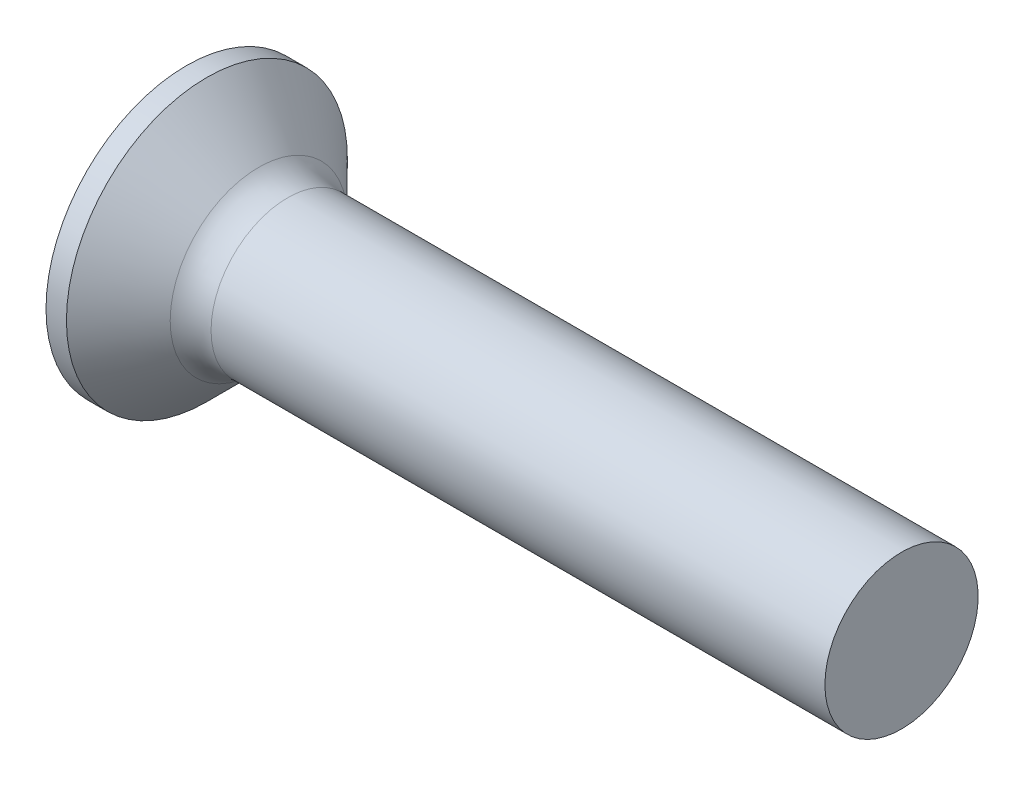
ISO-10303-21;
HEADER;
FILE_DESCRIPTION(('STEP AP214'),'2;1');
FILE_NAME('part.step','',(''),(''),'','','');
FILE_SCHEMA(('AUTOMOTIVE_DESIGN { 1 0 10303 214 1 1 1 1 }'));
ENDSEC;
DATA;
#1=APPLICATION_CONTEXT('core data for automotive mechanical design processes');
#2=APPLICATION_PROTOCOL_DEFINITION('international standard','automotive_design',2000,#1);
#3=PRODUCT_CONTEXT('',#1,'mechanical');
#4=PRODUCT('Part','Part','',(#3));
#5=PRODUCT_RELATED_PRODUCT_CATEGORY('part','',(#4));
#6=PRODUCT_DEFINITION_FORMATION('','',#4);
#7=PRODUCT_DEFINITION_CONTEXT('part definition',#1,'design');
#8=PRODUCT_DEFINITION('design','',#6,#7);
#9=PRODUCT_DEFINITION_SHAPE('','',#8);
#10=(LENGTH_UNIT() NAMED_UNIT(*) SI_UNIT(.MILLI.,.METRE.));
#11=(NAMED_UNIT(*) PLANE_ANGLE_UNIT() SI_UNIT($,.RADIAN.));
#12=(NAMED_UNIT(*) SI_UNIT($,.STERADIAN.) SOLID_ANGLE_UNIT());
#13=UNCERTAINTY_MEASURE_WITH_UNIT(LENGTH_MEASURE(1.E-05),#10,'distance_accuracy_value','');
#14=(GEOMETRIC_REPRESENTATION_CONTEXT(3) GLOBAL_UNCERTAINTY_ASSIGNED_CONTEXT((#13)) GLOBAL_UNIT_ASSIGNED_CONTEXT((#10,
#11,#12)) REPRESENTATION_CONTEXT('',''));
#15=CARTESIAN_POINT('',(0.,0.,0.));
#16=DIRECTION('',(0.,0.,1.));
#17=DIRECTION('',(1.,0.,0.));
#18=AXIS2_PLACEMENT_3D('',#15,#16,#17);
#19=CARTESIAN_POINT('',(2.01,-0.497851135403458,0.37));
#20=DIRECTION('',(0.,0.,-1.));
#21=DIRECTION('',(0.,1.,0.));
#22=AXIS2_PLACEMENT_3D('',#19,#20,#21);
#23=PLANE('',#22);
#24=DIRECTION('',(0.,-1.,0.));
#25=VECTOR('',#24,1.);
#26=CARTESIAN_POINT('',(0.,1.5,0.37));
#27=LINE('',#26,#25);
#28=CARTESIAN_POINT('',(0.,-0.590157547916263,0.37));
#29=VERTEX_POINT('',#28);
#30=CARTESIAN_POINT('',(0.,-1.5,0.37));
#31=VERTEX_POINT('',#30);
#32=EDGE_CURVE('E460',#29,#31,#27,.T.);
#33=ORIENTED_EDGE('',*,*,#32,.F.);
#34=CARTESIAN_POINT('',(-1.01053649691082,-0.672102030072118,0.37));
#35=CARTESIAN_POINT('',(-0.79970605871103,-0.655267098883947,0.37));
#36=CARTESIAN_POINT('',(-0.588886212503304,-0.638297110572311,0.37));
#37=CARTESIAN_POINT('',(-0.167272662529611,-0.603984130519828,0.37));
#38=CARTESIAN_POINT('',(0.0435210406290471,-0.586641131324258,0.37));
#39=CARTESIAN_POINT('',(0.465068838244709,-0.551479911667385,0.37));
#40=CARTESIAN_POINT('',(0.67582293271526,-0.533661691368909,0.37));
#41=CARTESIAN_POINT('',(1.09727362083221,-0.497387538872971,0.37));
#42=CARTESIAN_POINT('',(1.30797021521736,-0.478931615299089,0.37));
#43=CARTESIAN_POINT('',(1.67418894757201,-0.446067164121905,0.37));
#44=CARTESIAN_POINT('',(1.82972932585734,-0.431862501028414,0.37));
#45=CARTESIAN_POINT('',(2.14074770359484,-0.40279770973988,0.37));
#46=CARTESIAN_POINT('',(2.29622570356215,-0.38793758707517,0.37));
#47=CARTESIAN_POINT('',(2.60710169348415,-0.357305117937677,0.37));
#48=CARTESIAN_POINT('',(2.76249967840253,-0.34153271979064,0.37));
#49=CARTESIAN_POINT('',(2.99549070742189,-0.316847908281595,0.37));
#50=CARTESIAN_POINT('',(3.07313791118864,-0.308448465897182,0.37));
#51=CARTESIAN_POINT('',(3.22838341575769,-0.291202251048339,0.37));
#52=CARTESIAN_POINT('',(3.30598171599396,-0.282355473499083,0.37));
#53=CARTESIAN_POINT('',(3.38354828463398,-0.273232461289951,0.37));
#54=B_SPLINE_CURVE_WITH_KNOTS('',3,(#34,#35,#36,#37,#38,#39,#40,#41,#42,#43,#44,#45,#46,#47,#48,
#49,#50,#51,#52,#53),.UNSPECIFIED.,.F.,.F.,(4,2,2,2,2,2,2,2,2,4),(0.,0.634504777554396,
1.26902224766093,1.90353950036111,2.53804817592041,3.00661008438666,3.47516804019383,
3.94375256268972,4.17805198331267,4.41235406779909),.UNSPECIFIED.);
#55=CARTESIAN_POINT('',(2.01,-0.415013252800437,0.37));
#56=VERTEX_POINT('',#55);
#57=EDGE_CURVE('E216',#29,#56,#54,.T.);
#58=ORIENTED_EDGE('',*,*,#57,.T.);
#59=DIRECTION('',(0.,-1.,0.));
#60=VECTOR('',#59,1.);
#61=CARTESIAN_POINT('',(2.01,0.497851135403459,0.37));
#62=LINE('',#61,#60);
#63=CARTESIAN_POINT('',(2.01,-0.497851135403458,0.37));
#64=VERTEX_POINT('',#63);
#65=EDGE_CURVE('E369',#56,#64,#62,.T.);
#66=ORIENTED_EDGE('',*,*,#65,.T.);
#67=DIRECTION('',(0.894934391398442,0.446197753347436,0.));
#68=VECTOR('',#67,1.);
#69=CARTESIAN_POINT('',(0.,-1.5,0.37));
#70=LINE('',#69,#68);
#71=EDGE_CURVE('E468',#31,#64,#70,.T.);
#72=ORIENTED_EDGE('',*,*,#71,.F.);
#73=EDGE_LOOP('',(#33,#58,#66,#72));
#74=FACE_BOUND('',#73,.T.);
#75=ADVANCED_FACE('F37',(#74),#23,.T.);
#76=CARTESIAN_POINT('',(2.01,0.497851135403459,0.37));
#77=VERTEX_POINT('',#76);
#78=CARTESIAN_POINT('',(2.01,0.415013252800437,0.37));
#79=VERTEX_POINT('',#78);
#80=EDGE_CURVE('E365',#77,#79,#62,.T.);
#81=ORIENTED_EDGE('',*,*,#80,.T.);
#82=CARTESIAN_POINT('',(-1.01053649699026,0.672102030078459,0.37));
#83=CARTESIAN_POINT('',(-0.799706058781648,0.65526709888962,0.37));
#84=CARTESIAN_POINT('',(-0.588886212565099,0.63829711057731,0.37));
#85=CARTESIAN_POINT('',(-0.167272662573758,0.603984130523453,0.37));
#86=CARTESIAN_POINT('',(0.0435210405937219,0.586641131327185,0.37));
#87=CARTESIAN_POINT('',(0.465068838236453,0.551479911668094,0.37));
#88=CARTESIAN_POINT('',(0.675822932725248,0.533661691368078,0.37));
#89=CARTESIAN_POINT('',(1.09727362087867,0.497387538868943,0.37));
#90=CARTESIAN_POINT('',(1.30797021528206,0.478931615293404,0.37));
#91=CARTESIAN_POINT('',(1.67418894765493,0.446067164114376,0.37));
#92=CARTESIAN_POINT('',(1.82972932594025,0.431862501020785,0.37));
#93=CARTESIAN_POINT('',(2.14074770367772,0.402797709732015,0.37));
#94=CARTESIAN_POINT('',(2.29622570364503,0.38793758706717,0.37));
#95=CARTESIAN_POINT('',(2.60710169356699,0.357305117929346,0.37));
#96=CARTESIAN_POINT('',(2.76249967848536,0.341532719782115,0.37));
#97=CARTESIAN_POINT('',(2.99549070750468,0.316847908272698,0.37));
#98=CARTESIAN_POINT('',(3.07313791127142,0.308448465888148,0.37));
#99=CARTESIAN_POINT('',(3.22838341584044,0.291202251038989,0.37));
#100=CARTESIAN_POINT('',(3.30598171607669,0.282355473489554,0.37));
#101=CARTESIAN_POINT('',(3.38354828471668,0.273232461280215,0.37));
#102=B_SPLINE_CURVE_WITH_KNOTS('',3,(#82,#83,#84,#85,#86,#87,#88,#89,#90,#91,#92,#93,#94,#95,
#96,#97,#98,#99,#100,#101),.UNSPECIFIED.,.F.,.F.,(4,2,2,2,2,2,2,2,2,4),(0.,0.634504777580944,
1.26902224771403,1.90353950046914,2.53804817608336,3.00661008454961,3.47516804035678,
3.94375256285268,4.17805198347564,4.41235406796206),.UNSPECIFIED.);
#103=CARTESIAN_POINT('',(0.,0.590157547916263,0.37));
#104=VERTEX_POINT('',#103);
#105=EDGE_CURVE('E209',#79,#104,#102,.F.);
#106=ORIENTED_EDGE('',*,*,#105,.T.);
#107=CARTESIAN_POINT('',(0.,1.5,0.37));
#108=VERTEX_POINT('',#107);
#109=EDGE_CURVE('E462',#108,#104,#27,.T.);
#110=ORIENTED_EDGE('',*,*,#109,.F.);
#111=DIRECTION('',(0.894934391398442,-0.446197753347436,0.));
#112=VECTOR('',#111,1.);
#113=CARTESIAN_POINT('',(0.,1.5,0.37));
#114=LINE('',#113,#112);
#115=EDGE_CURVE('E60',#108,#77,#114,.T.);
#116=ORIENTED_EDGE('',*,*,#115,.T.);
#117=EDGE_LOOP('',(#81,#106,#110,#116));
#118=FACE_BOUND('',#117,.T.);
#119=ADVANCED_FACE('F191',(#118),#23,.T.);
#120=CARTESIAN_POINT('',(2.01,0.497851135403458,-0.37));
#121=DIRECTION('',(0.,0.,1.));
#122=DIRECTION('',(1.,0.,0.));
#123=AXIS2_PLACEMENT_3D('',#120,#121,#122);
#124=PLANE('',#123);
#125=DIRECTION('',(0.,1.,0.));
#126=VECTOR('',#125,1.);
#127=CARTESIAN_POINT('',(2.01,-0.497851135403459,-0.37));
#128=LINE('',#127,#126);
#129=CARTESIAN_POINT('',(2.01,-0.497851135403459,-0.37));
#130=VERTEX_POINT('',#129);
#131=CARTESIAN_POINT('',(2.01,-0.415013252800437,-0.37));
#132=VERTEX_POINT('',#131);
#133=EDGE_CURVE('E378',#130,#132,#128,.T.);
#134=ORIENTED_EDGE('',*,*,#133,.T.);
#135=CARTESIAN_POINT('',(-1.01053649699026,-0.672102030078459,-0.37));
#136=CARTESIAN_POINT('',(-0.799706058781648,-0.65526709888962,-0.37));
#137=CARTESIAN_POINT('',(-0.588886212565099,-0.63829711057731,-0.37));
#138=CARTESIAN_POINT('',(-0.167272662573759,-0.603984130523453,-0.37));
#139=CARTESIAN_POINT('',(0.0435210405937218,-0.586641131327185,-0.37));
#140=CARTESIAN_POINT('',(0.465068838236453,-0.551479911668094,-0.37));
#141=CARTESIAN_POINT('',(0.675822932725248,-0.533661691368078,-0.37));
#142=CARTESIAN_POINT('',(1.09727362087867,-0.497387538868943,-0.37));
#143=CARTESIAN_POINT('',(1.30797021528206,-0.478931615293404,-0.37));
#144=CARTESIAN_POINT('',(1.67418894765493,-0.446067164114376,-0.37));
#145=CARTESIAN_POINT('',(1.82972932594025,-0.431862501020785,-0.37));
#146=CARTESIAN_POINT('',(2.14074770367772,-0.402797709732015,-0.37));
#147=CARTESIAN_POINT('',(2.29622570364503,-0.38793758706717,-0.37));
#148=CARTESIAN_POINT('',(2.60710169356699,-0.357305117929346,-0.37));
#149=CARTESIAN_POINT('',(2.76249967848536,-0.341532719782116,-0.37));
#150=CARTESIAN_POINT('',(2.99549070750468,-0.316847908272698,-0.37));
#151=CARTESIAN_POINT('',(3.07313791127142,-0.308448465888148,-0.37));
#152=CARTESIAN_POINT('',(3.22838341584044,-0.291202251038989,-0.37));
#153=CARTESIAN_POINT('',(3.30598171607669,-0.282355473489554,-0.37));
#154=CARTESIAN_POINT('',(3.38354828471668,-0.273232461280215,-0.37));
#155=B_SPLINE_CURVE_WITH_KNOTS('',3,(#135,#136,#137,#138,#139,#140,#141,#142,#143,#144,#145,
#146,#147,#148,#149,#150,#151,#152,#153,#154),.UNSPECIFIED.,.F.,.F.,(4,2,2,2,2,2,2,2,2,4),(0.,
0.634504777580944,1.26902224771403,1.90353950046914,2.53804817608336,3.00661008454961,
3.47516804035678,3.94375256285268,4.17805198347564,4.41235406796206),.UNSPECIFIED.);
#156=CARTESIAN_POINT('',(0.,-0.590157547916263,-0.37));
#157=VERTEX_POINT('',#156);
#158=EDGE_CURVE('E272',#132,#157,#155,.F.);
#159=ORIENTED_EDGE('',*,*,#158,.T.);
#160=DIRECTION('',(0.,1.,0.));
#161=VECTOR('',#160,1.);
#162=CARTESIAN_POINT('',(0.,-1.5,-0.37));
#163=LINE('',#162,#161);
#164=CARTESIAN_POINT('',(0.,-1.5,-0.37));
#165=VERTEX_POINT('',#164);
#166=EDGE_CURVE('E461',#165,#157,#163,.T.);
#167=ORIENTED_EDGE('',*,*,#166,.F.);
#168=DIRECTION('',(0.894934391398442,0.446197753347436,0.));
#169=VECTOR('',#168,1.);
#170=CARTESIAN_POINT('',(0.,-1.5,-0.37));
#171=LINE('',#170,#169);
#172=EDGE_CURVE('E471',#165,#130,#171,.T.);
#173=ORIENTED_EDGE('',*,*,#172,.T.);
#174=EDGE_LOOP('',(#134,#159,#167,#173));
#175=FACE_BOUND('',#174,.T.);
#176=ADVANCED_FACE('F197',(#175),#124,.T.);
#177=CARTESIAN_POINT('',(0.,0.590157547916263,-0.37));
#178=VERTEX_POINT('',#177);
#179=CARTESIAN_POINT('',(0.,1.5,-0.37));
#180=VERTEX_POINT('',#179);
#181=EDGE_CURVE('E467',#178,#180,#163,.T.);
#182=ORIENTED_EDGE('',*,*,#181,.F.);
#183=CARTESIAN_POINT('',(-1.01053649699026,0.672102030078459,-0.37));
#184=CARTESIAN_POINT('',(-0.799706058781648,0.65526709888962,-0.37));
#185=CARTESIAN_POINT('',(-0.588886212565099,0.63829711057731,-0.37));
#186=CARTESIAN_POINT('',(-0.167272662573759,0.603984130523453,-0.37));
#187=CARTESIAN_POINT('',(0.0435210405937218,0.586641131327185,-0.37));
#188=CARTESIAN_POINT('',(0.465068838236453,0.551479911668094,-0.37));
#189=CARTESIAN_POINT('',(0.675822932725248,0.533661691368078,-0.37));
#190=CARTESIAN_POINT('',(1.09727362087867,0.497387538868943,-0.37));
#191=CARTESIAN_POINT('',(1.30797021528206,0.478931615293404,-0.37));
#192=CARTESIAN_POINT('',(1.67418894765493,0.446067164114376,-0.37));
#193=CARTESIAN_POINT('',(1.82972932594025,0.431862501020785,-0.37));
#194=CARTESIAN_POINT('',(2.14074770367772,0.402797709732015,-0.37));
#195=CARTESIAN_POINT('',(2.29622570364503,0.38793758706717,-0.37));
#196=CARTESIAN_POINT('',(2.60710169356699,0.357305117929346,-0.37));
#197=CARTESIAN_POINT('',(2.76249967848536,0.341532719782115,-0.37));
#198=CARTESIAN_POINT('',(2.99549070750468,0.316847908272698,-0.37));
#199=CARTESIAN_POINT('',(3.07313791127142,0.308448465888148,-0.37));
#200=CARTESIAN_POINT('',(3.22838341584044,0.291202251038989,-0.37));
#201=CARTESIAN_POINT('',(3.30598171607669,0.282355473489554,-0.37));
#202=CARTESIAN_POINT('',(3.38354828471668,0.273232461280215,-0.37));
#203=B_SPLINE_CURVE_WITH_KNOTS('',3,(#183,#184,#185,#186,#187,#188,#189,#190,#191,#192,#193,
#194,#195,#196,#197,#198,#199,#200,#201,#202),.UNSPECIFIED.,.F.,.F.,(4,2,2,2,2,2,2,2,2,4),(0.,
0.634504777580944,1.26902224771403,1.90353950046914,2.53804817608336,3.00661008454961,
3.47516804035678,3.94375256285268,4.17805198347564,4.41235406796206),.UNSPECIFIED.);
#204=CARTESIAN_POINT('',(2.01,0.415013252800437,-0.37));
#205=VERTEX_POINT('',#204);
#206=EDGE_CURVE('E266',#178,#205,#203,.T.);
#207=ORIENTED_EDGE('',*,*,#206,.T.);
#208=CARTESIAN_POINT('',(2.01,0.497851135403459,-0.37));
#209=VERTEX_POINT('',#208);
#210=EDGE_CURVE('E380',#205,#209,#128,.T.);
#211=ORIENTED_EDGE('',*,*,#210,.T.);
#212=DIRECTION('',(0.894934391398442,-0.446197753347436,0.));
#213=VECTOR('',#212,1.);
#214=CARTESIAN_POINT('',(0.,1.5,-0.37));
#215=LINE('',#214,#213);
#216=EDGE_CURVE('E377',#180,#209,#215,.T.);
#217=ORIENTED_EDGE('',*,*,#216,.F.);
#218=EDGE_LOOP('',(#182,#207,#211,#217));
#219=FACE_BOUND('',#218,.T.);
#220=ADVANCED_FACE('F478',(#219),#124,.T.);
#221=CARTESIAN_POINT('',(2.01,0.497851135403459,-0.37));
#222=DIRECTION('',(1.,0.,0.));
#223=DIRECTION('',(0.,0.,-1.));
#224=AXIS2_PLACEMENT_3D('',#221,#222,#223);
#225=PLANE('',#224);
#226=CARTESIAN_POINT('',(2.01,0.,0.));
#227=DIRECTION('',(-1.,0.,0.));
#228=DIRECTION('',(0.,0.,1.));
#229=AXIS2_PLACEMENT_3D('',#226,#227,#228);
#230=CIRCLE('',#229,0.555999999999999);
#231=CARTESIAN_POINT('',(2.01,-0.24754847399547,-0.497851135403459));
#232=VERTEX_POINT('',#231);
#233=CARTESIAN_POINT('',(2.01,-0.369999999999999,-0.415013252800438));
#234=VERTEX_POINT('',#233);
#235=EDGE_CURVE('E344',#232,#234,#230,.T.);
#236=ORIENTED_EDGE('',*,*,#235,.F.);
#237=DIRECTION('',(0.,1.,0.));
#238=VECTOR('',#237,1.);
#239=CARTESIAN_POINT('',(2.01,-0.369999999999998,-0.49785113540346));
#240=LINE('',#239,#238);
#241=CARTESIAN_POINT('',(2.01,-0.369999999999998,-0.49785113540346));
#242=VERTEX_POINT('',#241);
#243=EDGE_CURVE('E445',#242,#232,#240,.T.);
#244=ORIENTED_EDGE('',*,*,#243,.F.);
#245=DIRECTION('',(0.,0.,-1.));
#246=VECTOR('',#245,1.);
#247=CARTESIAN_POINT('',(2.01,-0.370000000000002,0.497851135403457));
#248=LINE('',#247,#246);
#249=EDGE_CURVE('E449',#234,#242,#248,.T.);
#250=ORIENTED_EDGE('',*,*,#249,.F.);
#251=EDGE_LOOP('',(#236,#244,#250));
#252=FACE_BOUND('',#251,.T.);
#253=ADVANCED_FACE('F491',(#252),#225,.F.);
#254=CARTESIAN_POINT('',(2.01,-0.497851135403459,-0.247548473995471));
#255=VERTEX_POINT('',#254);
#256=EDGE_CURVE('E339',#132,#255,#230,.T.);
#257=ORIENTED_EDGE('',*,*,#256,.F.);
#258=ORIENTED_EDGE('',*,*,#133,.F.);
#259=DIRECTION('',(0.,0.,-1.));
#260=VECTOR('',#259,1.);
#261=CARTESIAN_POINT('',(2.01,-0.497851135403458,0.37));
#262=LINE('',#261,#260);
#263=EDGE_CURVE('E368',#255,#130,#262,.T.);
#264=ORIENTED_EDGE('',*,*,#263,.F.);
#265=EDGE_LOOP('',(#257,#258,#264));
#266=FACE_BOUND('',#265,.T.);
#267=ADVANCED_FACE('F497',(#266),#225,.F.);
#268=CARTESIAN_POINT('',(2.01,-0.497851135403458,0.247548473995472));
#269=VERTEX_POINT('',#268);
#270=EDGE_CURVE('E334',#269,#56,#230,.T.);
#271=ORIENTED_EDGE('',*,*,#270,.F.);
#272=EDGE_CURVE('E371',#64,#269,#262,.T.);
#273=ORIENTED_EDGE('',*,*,#272,.F.);
#274=ORIENTED_EDGE('',*,*,#65,.F.);
#275=EDGE_LOOP('',(#271,#273,#274));
#276=FACE_BOUND('',#275,.T.);
#277=ADVANCED_FACE('F503',(#276),#225,.F.);
#278=CARTESIAN_POINT('',(2.01,-0.370000000000001,0.415013252800436));
#279=VERTEX_POINT('',#278);
#280=CARTESIAN_POINT('',(2.01,-0.247548473995473,0.497851135403458));
#281=VERTEX_POINT('',#280);
#282=EDGE_CURVE('E52',#279,#281,#230,.T.);
#283=ORIENTED_EDGE('',*,*,#282,.F.);
#284=CARTESIAN_POINT('',(2.01,-0.370000000000002,0.497851135403457));
#285=VERTEX_POINT('',#284);
#286=EDGE_CURVE('E451',#285,#279,#248,.T.);
#287=ORIENTED_EDGE('',*,*,#286,.F.);
#288=DIRECTION('',(0.,-1.,0.));
#289=VECTOR('',#288,1.);
#290=CARTESIAN_POINT('',(2.01,0.369999999999998,0.49785113540346));
#291=LINE('',#290,#289);
#292=EDGE_CURVE('E450',#281,#285,#291,.T.);
#293=ORIENTED_EDGE('',*,*,#292,.F.);
#294=EDGE_LOOP('',(#283,#287,#293));
#295=FACE_BOUND('',#294,.T.);
#296=ADVANCED_FACE('F530',(#295),#225,.F.);
#297=CARTESIAN_POINT('',(2.01,0.24754847399547,0.497851135403459));
#298=VERTEX_POINT('',#297);
#299=CARTESIAN_POINT('',(2.01,0.369999999999999,0.415013252800438));
#300=VERTEX_POINT('',#299);
#301=EDGE_CURVE('E325',#298,#300,#230,.T.);
#302=ORIENTED_EDGE('',*,*,#301,.F.);
#303=CARTESIAN_POINT('',(2.01,0.369999999999998,0.49785113540346));
#304=VERTEX_POINT('',#303);
#305=EDGE_CURVE('E446',#304,#298,#291,.T.);
#306=ORIENTED_EDGE('',*,*,#305,.F.);
#307=DIRECTION('',(0.,0.,1.));
#308=VECTOR('',#307,1.);
#309=CARTESIAN_POINT('',(2.01,0.370000000000002,-0.497851135403457));
#310=LINE('',#309,#308);
#311=EDGE_CURVE('E223',#300,#304,#310,.T.);
#312=ORIENTED_EDGE('',*,*,#311,.F.);
#313=EDGE_LOOP('',(#302,#306,#312));
#314=FACE_BOUND('',#313,.T.);
#315=ADVANCED_FACE('F487',(#314),#225,.F.);
#316=CARTESIAN_POINT('',(2.01,0.497851135403459,0.247548473995471));
#317=VERTEX_POINT('',#316);
#318=EDGE_CURVE('E332',#79,#317,#230,.T.);
#319=ORIENTED_EDGE('',*,*,#318,.F.);
#320=ORIENTED_EDGE('',*,*,#80,.F.);
#321=DIRECTION('',(0.,0.,1.));
#322=VECTOR('',#321,1.);
#323=CARTESIAN_POINT('',(2.01,0.497851135403459,-0.37));
#324=LINE('',#323,#322);
#325=EDGE_CURVE('E366',#317,#77,#324,.T.);
#326=ORIENTED_EDGE('',*,*,#325,.F.);
#327=EDGE_LOOP('',(#319,#320,#326));
#328=FACE_BOUND('',#327,.T.);
#329=ADVANCED_FACE('F364',(#328),#225,.F.);
#330=CARTESIAN_POINT('',(2.01,0.497851135403459,-0.247548473995471));
#331=VERTEX_POINT('',#330);
#332=EDGE_CURVE('E354',#331,#205,#230,.T.);
#333=ORIENTED_EDGE('',*,*,#332,.F.);
#334=EDGE_CURVE('E373',#209,#331,#324,.T.);
#335=ORIENTED_EDGE('',*,*,#334,.F.);
#336=ORIENTED_EDGE('',*,*,#210,.F.);
#337=EDGE_LOOP('',(#333,#335,#336));
#338=FACE_BOUND('',#337,.T.);
#339=ADVANCED_FACE('F480',(#338),#225,.F.);
#340=CARTESIAN_POINT('',(2.01,-0.497851135403459,-0.37));
#341=DIRECTION('',(-0.446197753347436,0.894934391398443,0.));
#342=DIRECTION('',(-0.894934391398442,-0.446197753347436,0.));
#343=AXIS2_PLACEMENT_3D('',#340,#341,#342);
#344=PLANE('',#343);
#345=ORIENTED_EDGE('',*,*,#272,.T.);
#346=CARTESIAN_POINT('',(2.86902919914418,-0.0695550475538963,0.));
#347=DIRECTION('',(-0.446197753347436,0.894934391398443,0.));
#348=DIRECTION('',(-0.894934391398443,-0.446197753347436,0.));
#349=AXIS2_PLACEMENT_3D('',#346,#347,#348);
#350=ELLIPSE('',#349,1.11145971268776,0.491029001453358);
#351=EDGE_CURVE('E284',#269,#255,#350,.F.);
#352=ORIENTED_EDGE('',*,*,#351,.T.);
#353=ORIENTED_EDGE('',*,*,#263,.T.);
#354=ORIENTED_EDGE('',*,*,#172,.F.);
#355=DIRECTION('',(0.,0.,-1.));
#356=VECTOR('',#355,1.);
#357=CARTESIAN_POINT('',(0.,-1.5,0.37));
#358=LINE('',#357,#356);
#359=EDGE_CURVE('E385',#31,#165,#358,.T.);
#360=ORIENTED_EDGE('',*,*,#359,.F.);
#361=ORIENTED_EDGE('',*,*,#71,.T.);
#362=EDGE_LOOP('',(#345,#352,#353,#354,#360,#361));
#363=FACE_BOUND('',#362,.T.);
#364=ADVANCED_FACE('F203',(#363),#344,.T.);
#365=CARTESIAN_POINT('',(2.01,0.497851135403459,0.37));
#366=DIRECTION('',(-0.446197753347436,-0.894934391398443,0.));
#367=DIRECTION('',(0.894934391398442,-0.446197753347436,0.));
#368=AXIS2_PLACEMENT_3D('',#365,#366,#367);
#369=PLANE('',#368);
#370=ORIENTED_EDGE('',*,*,#334,.T.);
#371=CARTESIAN_POINT('',(2.86902919914418,0.0695550475538964,0.));
#372=DIRECTION('',(-0.446197753347436,-0.894934391398443,0.));
#373=DIRECTION('',(-0.894934391398443,0.446197753347436,0.));
#374=AXIS2_PLACEMENT_3D('',#371,#372,#373);
#375=ELLIPSE('',#374,1.11145971268776,0.491029001453358);
#376=EDGE_CURVE('E289',#331,#317,#375,.F.);
#377=ORIENTED_EDGE('',*,*,#376,.T.);
#378=ORIENTED_EDGE('',*,*,#325,.T.);
#379=ORIENTED_EDGE('',*,*,#115,.F.);
#380=DIRECTION('',(0.,0.,1.));
#381=VECTOR('',#380,1.);
#382=CARTESIAN_POINT('',(0.,1.5,-0.37));
#383=LINE('',#382,#381);
#384=EDGE_CURVE('E457',#180,#108,#383,.T.);
#385=ORIENTED_EDGE('',*,*,#384,.F.);
#386=ORIENTED_EDGE('',*,*,#216,.T.);
#387=EDGE_LOOP('',(#370,#377,#378,#379,#385,#386));
#388=FACE_BOUND('',#387,.T.);
#389=ADVANCED_FACE('F476',(#388),#369,.T.);
#390=CARTESIAN_POINT('',(2.01,0.369999999999998,0.49785113540346));
#391=DIRECTION('',(0.,-1.,0.));
#392=DIRECTION('',(1.,0.,0.));
#393=AXIS2_PLACEMENT_3D('',#390,#391,#392);
#394=PLANE('',#393);
#395=CARTESIAN_POINT('',(2.01,0.370000000000002,-0.497851135403457));
#396=VERTEX_POINT('',#395);
#397=CARTESIAN_POINT('',(2.01,0.370000000000001,-0.415013252800436));
#398=VERTEX_POINT('',#397);
#399=EDGE_CURVE('E455',#396,#398,#310,.T.);
#400=ORIENTED_EDGE('',*,*,#399,.T.);
#401=CARTESIAN_POINT('',(-1.01053649691082,0.370000000000002,-0.672102030072117));
#402=CARTESIAN_POINT('',(-0.79970605871103,0.370000000000002,-0.655267098883946));
#403=CARTESIAN_POINT('',(-0.588886212503304,0.370000000000002,-0.63829711057231));
#404=CARTESIAN_POINT('',(-0.167272662529611,0.370000000000002,-0.603984130519827));
#405=CARTESIAN_POINT('',(0.0435210406290471,0.370000000000002,-0.586641131324257));
#406=CARTESIAN_POINT('',(0.465068838244709,0.370000000000002,-0.551479911667384));
#407=CARTESIAN_POINT('',(0.67582293271526,0.370000000000002,-0.533661691368908));
#408=CARTESIAN_POINT('',(1.09727362083221,0.370000000000002,-0.49738753887297));
#409=CARTESIAN_POINT('',(1.30797021521736,0.370000000000002,-0.478931615299088));
#410=CARTESIAN_POINT('',(1.67418894757201,0.370000000000001,-0.446067164121904));
#411=CARTESIAN_POINT('',(1.82972932585734,0.370000000000001,-0.431862501028413));
#412=CARTESIAN_POINT('',(2.14074770359484,0.370000000000001,-0.402797709739879));
#413=CARTESIAN_POINT('',(2.29622570356215,0.370000000000001,-0.387937587075169));
#414=CARTESIAN_POINT('',(2.60710169348415,0.370000000000001,-0.357305117937675));
#415=CARTESIAN_POINT('',(2.76249967840253,0.370000000000001,-0.341532719790639));
#416=CARTESIAN_POINT('',(2.99549070742189,0.370000000000001,-0.316847908281593));
#417=CARTESIAN_POINT('',(3.07313791118864,0.370000000000001,-0.308448465897181));
#418=CARTESIAN_POINT('',(3.22838341575769,0.370000000000001,-0.291202251048338));
#419=CARTESIAN_POINT('',(3.30598171599396,0.370000000000001,-0.282355473499081));
#420=CARTESIAN_POINT('',(3.38354828463398,0.370000000000001,-0.273232461289949));
#421=B_SPLINE_CURVE_WITH_KNOTS('',3,(#401,#402,#403,#404,#405,#406,#407,#408,#409,#410,#411,
#412,#413,#414,#415,#416,#417,#418,#419,#420),.UNSPECIFIED.,.F.,.F.,(4,2,2,2,2,2,2,2,2,4),(0.,
0.634504777554396,1.26902224766093,1.90353950036111,2.53804817592041,3.00661008438666,
3.47516804019383,3.94375256268972,4.17805198331267,4.41235406779909),.UNSPECIFIED.);
#422=CARTESIAN_POINT('',(0.,0.370000000000002,-0.590157547916262));
#423=VERTEX_POINT('',#422);
#424=EDGE_CURVE('E258',#398,#423,#421,.F.);
#425=ORIENTED_EDGE('',*,*,#424,.T.);
#426=DIRECTION('',(0.,0.,1.));
#427=VECTOR('',#426,1.);
#428=CARTESIAN_POINT('',(0.,0.370000000000005,-1.5));
#429=LINE('',#428,#427);
#430=CARTESIAN_POINT('',(0.,0.370000000000005,-1.5));
#431=VERTEX_POINT('',#430);
#432=EDGE_CURVE('E431',#431,#423,#429,.T.);
#433=ORIENTED_EDGE('',*,*,#432,.F.);
#434=DIRECTION('',(0.894934391398442,0.,0.446197753347436));
#435=VECTOR('',#434,1.);
#436=CARTESIAN_POINT('',(0.,0.370000000000005,-1.5));
#437=LINE('',#436,#435);
#438=EDGE_CURVE('E437',#431,#396,#437,.T.);
#439=ORIENTED_EDGE('',*,*,#438,.T.);
#440=EDGE_LOOP('',(#400,#425,#433,#439));
#441=FACE_BOUND('',#440,.T.);
#442=ADVANCED_FACE('F610',(#441),#394,.T.);
#443=CARTESIAN_POINT('',(2.01,-0.369999999999998,-0.497851135403459));
#444=DIRECTION('',(0.,1.,0.));
#445=DIRECTION('',(0.,0.,1.));
#446=AXIS2_PLACEMENT_3D('',#443,#444,#445);
#447=PLANE('',#446);
#448=DIRECTION('',(0.,0.,-1.));
#449=VECTOR('',#448,1.);
#450=CARTESIAN_POINT('',(0.,-0.370000000000005,1.5));
#451=LINE('',#450,#449);
#452=CARTESIAN_POINT('',(0.,-0.369999999999998,-0.590157547916264));
#453=VERTEX_POINT('',#452);
#454=CARTESIAN_POINT('',(0.,-0.369999999999995,-1.5));
#455=VERTEX_POINT('',#454);
#456=EDGE_CURVE('E427',#453,#455,#451,.T.);
#457=ORIENTED_EDGE('',*,*,#456,.F.);
#458=CARTESIAN_POINT('',(-1.01053649699026,-0.369999999999998,-0.67210203007846));
#459=CARTESIAN_POINT('',(-0.799706058781648,-0.369999999999998,-0.655267098889621));
#460=CARTESIAN_POINT('',(-0.588886212565099,-0.369999999999998,-0.638297110577311));
#461=CARTESIAN_POINT('',(-0.167272662573759,-0.369999999999998,-0.603984130523454));
#462=CARTESIAN_POINT('',(0.043521040593722,-0.369999999999998,-0.586641131327186));
#463=CARTESIAN_POINT('',(0.465068838236453,-0.369999999999998,-0.551479911668095));
#464=CARTESIAN_POINT('',(0.675822932725248,-0.369999999999998,-0.53366169136808));
#465=CARTESIAN_POINT('',(1.09727362087867,-0.369999999999998,-0.497387538868944));
#466=CARTESIAN_POINT('',(1.30797021528206,-0.369999999999998,-0.478931615293405));
#467=CARTESIAN_POINT('',(1.67418894765493,-0.369999999999999,-0.446067164114377));
#468=CARTESIAN_POINT('',(1.82972932594025,-0.369999999999999,-0.431862501020786));
#469=CARTESIAN_POINT('',(2.14074770367772,-0.369999999999999,-0.402797709732017));
#470=CARTESIAN_POINT('',(2.29622570364503,-0.369999999999999,-0.387937587067171));
#471=CARTESIAN_POINT('',(2.60710169356699,-0.369999999999999,-0.357305117929348));
#472=CARTESIAN_POINT('',(2.76249967848536,-0.369999999999999,-0.341532719782116));
#473=CARTESIAN_POINT('',(2.99549070750468,-0.369999999999999,-0.316847908272699));
#474=CARTESIAN_POINT('',(3.07313791127142,-0.369999999999999,-0.308448465888149));
#475=CARTESIAN_POINT('',(3.22838341584044,-0.369999999999999,-0.29120225103899));
#476=CARTESIAN_POINT('',(3.30598171607669,-0.369999999999999,-0.282355473489555));
#477=CARTESIAN_POINT('',(3.38354828471668,-0.369999999999999,-0.273232461280217));
#478=B_SPLINE_CURVE_WITH_KNOTS('',3,(#458,#459,#460,#461,#462,#463,#464,#465,#466,#467,#468,
#469,#470,#471,#472,#473,#474,#475,#476,#477),.UNSPECIFIED.,.F.,.F.,(4,2,2,2,2,2,2,2,2,4),(0.,
0.634504777580944,1.26902224771403,1.90353950046914,2.53804817608336,3.00661008454961,
3.47516804035678,3.94375256285268,4.17805198347564,4.41235406796206),.UNSPECIFIED.);
#479=EDGE_CURVE('E251',#453,#234,#478,.T.);
#480=ORIENTED_EDGE('',*,*,#479,.T.);
#481=ORIENTED_EDGE('',*,*,#249,.T.);
#482=DIRECTION('',(0.894934391398442,0.,0.446197753347436));
#483=VECTOR('',#482,1.);
#484=CARTESIAN_POINT('',(0.,-0.369999999999995,-1.5));
#485=LINE('',#484,#483);
#486=EDGE_CURVE('E434',#455,#242,#485,.T.);
#487=ORIENTED_EDGE('',*,*,#486,.F.);
#488=EDGE_LOOP('',(#457,#480,#481,#487));
#489=FACE_BOUND('',#488,.T.);
#490=ADVANCED_FACE('F508',(#489),#447,.T.);
#491=CARTESIAN_POINT('',(2.01,0.370000000000002,-0.497851135403457));
#492=DIRECTION('',(-0.446197753347436,0.,0.894934391398443));
#493=DIRECTION('',(-0.894934391398442,0.,-0.446197753347436));
#494=AXIS2_PLACEMENT_3D('',#491,#492,#493);
#495=PLANE('',#494);
#496=ORIENTED_EDGE('',*,*,#243,.T.);
#497=CARTESIAN_POINT('',(2.86902919914418,0.,-0.0695550475538963));
#498=DIRECTION('',(-0.446197753347436,0.,0.894934391398443));
#499=DIRECTION('',(-0.894934391398443,0.,-0.446197753347436));
#500=AXIS2_PLACEMENT_3D('',#497,#498,#499);
#501=ELLIPSE('',#500,1.11145971268776,0.491029001453358);
#502=CARTESIAN_POINT('',(2.01,0.247548473995473,-0.497851135403458));
#503=VERTEX_POINT('',#502);
#504=EDGE_CURVE('E302',#232,#503,#501,.F.);
#505=ORIENTED_EDGE('',*,*,#504,.T.);
#506=EDGE_CURVE('E453',#503,#396,#240,.T.);
#507=ORIENTED_EDGE('',*,*,#506,.T.);
#508=ORIENTED_EDGE('',*,*,#438,.F.);
#509=DIRECTION('',(0.,1.,0.));
#510=VECTOR('',#509,1.);
#511=CARTESIAN_POINT('',(0.,-0.369999999999995,-1.5));
#512=LINE('',#511,#510);
#513=EDGE_CURVE('E426',#455,#431,#512,.T.);
#514=ORIENTED_EDGE('',*,*,#513,.F.);
#515=ORIENTED_EDGE('',*,*,#486,.T.);
#516=EDGE_LOOP('',(#496,#505,#507,#508,#514,#515));
#517=FACE_BOUND('',#516,.T.);
#518=ADVANCED_FACE('F228',(#517),#495,.T.);
#519=ORIENTED_EDGE('',*,*,#286,.T.);
#520=CARTESIAN_POINT('',(-1.01053649699026,-0.370000000000002,0.672102030078458));
#521=CARTESIAN_POINT('',(-0.799706058781648,-0.370000000000002,0.655267098889619));
#522=CARTESIAN_POINT('',(-0.588886212565099,-0.370000000000002,0.638297110577308));
#523=CARTESIAN_POINT('',(-0.167272662573759,-0.370000000000002,0.603984130523451));
#524=CARTESIAN_POINT('',(0.0435210405937216,-0.370000000000002,0.586641131327183));
#525=CARTESIAN_POINT('',(0.465068838236452,-0.370000000000002,0.551479911668093));
#526=CARTESIAN_POINT('',(0.675822932725248,-0.370000000000002,0.533661691368077));
#527=CARTESIAN_POINT('',(1.09727362087867,-0.370000000000002,0.497387538868942));
#528=CARTESIAN_POINT('',(1.30797021528206,-0.370000000000002,0.478931615293403));
#529=CARTESIAN_POINT('',(1.67418894765493,-0.370000000000002,0.446067164114375));
#530=CARTESIAN_POINT('',(1.82972932594025,-0.370000000000002,0.431862501020784));
#531=CARTESIAN_POINT('',(2.14074770367772,-0.370000000000001,0.402797709732014));
#532=CARTESIAN_POINT('',(2.29622570364503,-0.370000000000001,0.387937587067169));
#533=CARTESIAN_POINT('',(2.60710169356699,-0.370000000000001,0.357305117929345));
#534=CARTESIAN_POINT('',(2.76249967848536,-0.370000000000001,0.341532719782114));
#535=CARTESIAN_POINT('',(2.99549070750468,-0.370000000000001,0.316847908272697));
#536=CARTESIAN_POINT('',(3.07313791127142,-0.370000000000001,0.308448465888147));
#537=CARTESIAN_POINT('',(3.22838341584044,-0.370000000000001,0.291202251038988));
#538=CARTESIAN_POINT('',(3.30598171607669,-0.370000000000001,0.282355473489552));
#539=CARTESIAN_POINT('',(3.38354828471668,-0.370000000000001,0.273232461280214));
#540=B_SPLINE_CURVE_WITH_KNOTS('',3,(#520,#521,#522,#523,#524,#525,#526,#527,#528,#529,#530,
#531,#532,#533,#534,#535,#536,#537,#538,#539),.UNSPECIFIED.,.F.,.F.,(4,2,2,2,2,2,2,2,2,4),(0.,
0.634504777580944,1.26902224771403,1.90353950046914,2.53804817608336,3.00661008454961,
3.47516804035678,3.94375256285268,4.17805198347564,4.41235406796206),.UNSPECIFIED.);
#541=CARTESIAN_POINT('',(0.,-0.370000000000002,0.590157547916262));
#542=VERTEX_POINT('',#541);
#543=EDGE_CURVE('E243',#279,#542,#540,.F.);
#544=ORIENTED_EDGE('',*,*,#543,.T.);
#545=CARTESIAN_POINT('',(0.,-0.370000000000005,1.5));
#546=VERTEX_POINT('',#545);
#547=EDGE_CURVE('E422',#546,#542,#451,.T.);
#548=ORIENTED_EDGE('',*,*,#547,.F.);
#549=DIRECTION('',(0.894934391398442,0.,-0.446197753347436));
#550=VECTOR('',#549,1.);
#551=CARTESIAN_POINT('',(0.,-0.370000000000005,1.5));
#552=LINE('',#551,#550);
#553=EDGE_CURVE('E440',#546,#285,#552,.T.);
#554=ORIENTED_EDGE('',*,*,#553,.T.);
#555=EDGE_LOOP('',(#519,#544,#548,#554));
#556=FACE_BOUND('',#555,.T.);
#557=ADVANCED_FACE('F528',(#556),#447,.T.);
#558=CARTESIAN_POINT('',(0.,0.369999999999998,0.590157547916264));
#559=VERTEX_POINT('',#558);
#560=CARTESIAN_POINT('',(0.,0.369999999999994,1.5));
#561=VERTEX_POINT('',#560);
#562=EDGE_CURVE('E433',#559,#561,#429,.T.);
#563=ORIENTED_EDGE('',*,*,#562,.F.);
#564=CARTESIAN_POINT('',(-1.01053649699026,0.369999999999997,0.67210203007846));
#565=CARTESIAN_POINT('',(-0.799706058781648,0.369999999999997,0.655267098889622));
#566=CARTESIAN_POINT('',(-0.588886212565099,0.369999999999997,0.638297110577311));
#567=CARTESIAN_POINT('',(-0.167272662573758,0.369999999999998,0.603984130523454));
#568=CARTESIAN_POINT('',(0.0435210405937219,0.369999999999998,0.586641131327186));
#569=CARTESIAN_POINT('',(0.465068838236453,0.369999999999998,0.551479911668095));
#570=CARTESIAN_POINT('',(0.675822932725248,0.369999999999998,0.53366169136808));
#571=CARTESIAN_POINT('',(1.09727362087867,0.369999999999998,0.497387538868944));
#572=CARTESIAN_POINT('',(1.30797021528206,0.369999999999998,0.478931615293405));
#573=CARTESIAN_POINT('',(1.67418894765493,0.369999999999998,0.446067164114377));
#574=CARTESIAN_POINT('',(1.82972932594025,0.369999999999998,0.431862501020786));
#575=CARTESIAN_POINT('',(2.14074770367772,0.369999999999999,0.402797709732017));
#576=CARTESIAN_POINT('',(2.29622570364503,0.369999999999999,0.387937587067171));
#577=CARTESIAN_POINT('',(2.60710169356699,0.369999999999999,0.357305117929348));
#578=CARTESIAN_POINT('',(2.76249967848536,0.369999999999999,0.341532719782117));
#579=CARTESIAN_POINT('',(2.99549070750468,0.369999999999999,0.316847908272699));
#580=CARTESIAN_POINT('',(3.07313791127142,0.369999999999999,0.308448465888149));
#581=CARTESIAN_POINT('',(3.22838341584044,0.369999999999999,0.29120225103899));
#582=CARTESIAN_POINT('',(3.30598171607669,0.369999999999999,0.282355473489555));
#583=CARTESIAN_POINT('',(3.38354828471668,0.369999999999999,0.273232461280217));
#584=B_SPLINE_CURVE_WITH_KNOTS('',3,(#564,#565,#566,#567,#568,#569,#570,#571,#572,#573,#574,
#575,#576,#577,#578,#579,#580,#581,#582,#583),.UNSPECIFIED.,.F.,.F.,(4,2,2,2,2,2,2,2,2,4),(0.,
0.634504777580944,1.26902224771403,1.90353950046914,2.53804817608336,3.00661008454961,
3.47516804035678,3.94375256285268,4.17805198347564,4.41235406796206),.UNSPECIFIED.);
#585=EDGE_CURVE('E233',#559,#300,#584,.T.);
#586=ORIENTED_EDGE('',*,*,#585,.T.);
#587=ORIENTED_EDGE('',*,*,#311,.T.);
#588=DIRECTION('',(0.894934391398442,0.,-0.446197753347436));
#589=VECTOR('',#588,1.);
#590=CARTESIAN_POINT('',(0.,0.369999999999994,1.5));
#591=LINE('',#590,#589);
#592=EDGE_CURVE('E442',#561,#304,#591,.T.);
#593=ORIENTED_EDGE('',*,*,#592,.F.);
#594=EDGE_LOOP('',(#563,#586,#587,#593));
#595=FACE_BOUND('',#594,.T.);
#596=ADVANCED_FACE('F523',(#595),#394,.T.);
#597=CARTESIAN_POINT('',(2.01,-0.370000000000002,0.497851135403457));
#598=DIRECTION('',(-0.446197753347436,0.,-0.894934391398443));
#599=DIRECTION('',(0.894934391398442,0.,-0.446197753347436));
#600=AXIS2_PLACEMENT_3D('',#597,#598,#599);
#601=PLANE('',#600);
#602=ORIENTED_EDGE('',*,*,#305,.T.);
#603=CARTESIAN_POINT('',(2.86902919914418,0.,0.0695550475538964));
#604=DIRECTION('',(-0.446197753347436,0.,-0.894934391398443));
#605=DIRECTION('',(-0.894934391398443,0.,0.446197753347436));
#606=AXIS2_PLACEMENT_3D('',#603,#604,#605);
#607=ELLIPSE('',#606,1.11145971268776,0.491029001453358);
#608=EDGE_CURVE('E11',#298,#281,#607,.F.);
#609=ORIENTED_EDGE('',*,*,#608,.T.);
#610=ORIENTED_EDGE('',*,*,#292,.T.);
#611=ORIENTED_EDGE('',*,*,#553,.F.);
#612=DIRECTION('',(0.,-1.,0.));
#613=VECTOR('',#612,1.);
#614=CARTESIAN_POINT('',(0.,0.369999999999994,1.5));
#615=LINE('',#614,#613);
#616=EDGE_CURVE('E224',#561,#546,#615,.T.);
#617=ORIENTED_EDGE('',*,*,#616,.F.);
#618=ORIENTED_EDGE('',*,*,#592,.T.);
#619=EDGE_LOOP('',(#602,#609,#610,#611,#617,#618));
#620=FACE_BOUND('',#619,.T.);
#621=ADVANCED_FACE('F420',(#620),#601,.T.);
#622=CARTESIAN_POINT('',(0.,0.,0.));
#623=DIRECTION('',(-1.,0.,0.));
#624=DIRECTION('',(0.,0.,1.));
#625=AXIS2_PLACEMENT_3D('',#622,#623,#624);
#626=PLANE('',#625);
#627=CARTESIAN_POINT('',(0.,0.,0.));
#628=DIRECTION('',(-1.,0.,0.));
#629=DIRECTION('',(0.,0.,1.));
#630=AXIS2_PLACEMENT_3D('',#627,#628,#629);
#631=CIRCLE('',#630,2.75);
#632=CARTESIAN_POINT('',(0.,0.,2.75));
#633=VERTEX_POINT('',#632);
#634=EDGE_CURVE('E388',#633,#633,#631,.T.);
#635=ORIENTED_EDGE('',*,*,#634,.T.);
#636=EDGE_LOOP('',(#635));
#637=FACE_BOUND('',#636,.T.);
#638=ORIENTED_EDGE('',*,*,#547,.T.);
#639=CARTESIAN_POINT('',(0.,0.,0.));
#640=DIRECTION('',(-1.,0.,0.));
#641=DIRECTION('',(0.,0.,1.));
#642=AXIS2_PLACEMENT_3D('',#639,#640,#641);
#643=CIRCLE('',#642,0.696552892006441);
#644=EDGE_CURVE('E320',#29,#542,#643,.T.);
#645=ORIENTED_EDGE('',*,*,#644,.F.);
#646=ORIENTED_EDGE('',*,*,#32,.T.);
#647=ORIENTED_EDGE('',*,*,#359,.T.);
#648=ORIENTED_EDGE('',*,*,#166,.T.);
#649=EDGE_CURVE('E323',#453,#157,#643,.T.);
#650=ORIENTED_EDGE('',*,*,#649,.F.);
#651=ORIENTED_EDGE('',*,*,#456,.T.);
#652=ORIENTED_EDGE('',*,*,#513,.T.);
#653=ORIENTED_EDGE('',*,*,#432,.T.);
#654=EDGE_CURVE('E319',#178,#423,#643,.T.);
#655=ORIENTED_EDGE('',*,*,#654,.F.);
#656=ORIENTED_EDGE('',*,*,#181,.T.);
#657=ORIENTED_EDGE('',*,*,#384,.T.);
#658=ORIENTED_EDGE('',*,*,#109,.T.);
#659=EDGE_CURVE('E315',#559,#104,#643,.T.);
#660=ORIENTED_EDGE('',*,*,#659,.F.);
#661=ORIENTED_EDGE('',*,*,#562,.T.);
#662=ORIENTED_EDGE('',*,*,#616,.T.);
#663=EDGE_LOOP('',(#638,#645,#646,#647,#648,#650,#651,#652,#653,#655,#656,#657,#658,#660,#661,#662));
#664=FACE_BOUND('',#663,.T.);
#665=ADVANCED_FACE('F414',(#637,#664),#626,.T.);
#666=CARTESIAN_POINT('',(-6.34999999999999,0.,0.));
#667=DIRECTION('',(-1.,0.,0.));
#668=DIRECTION('',(0.,0.,1.));
#669=AXIS2_PLACEMENT_3D('',#666,#667,#668);
#670=CYLINDRICAL_SURFACE('',#669,2.75);
#671=CARTESIAN_POINT('',(0.400000000000005,0.,0.));
#672=DIRECTION('',(-1.,0.,0.));
#673=DIRECTION('',(0.,0.,1.));
#674=AXIS2_PLACEMENT_3D('',#671,#672,#673);
#675=CIRCLE('',#674,2.75);
#676=CARTESIAN_POINT('',(0.400000000000005,0.,2.75));
#677=VERTEX_POINT('',#676);
#678=EDGE_CURVE('E384',#677,#677,#675,.T.);
#679=ORIENTED_EDGE('',*,*,#678,.T.);
#680=EDGE_LOOP('',(#679));
#681=FACE_BOUND('',#680,.T.);
#682=ORIENTED_EDGE('',*,*,#634,.F.);
#683=EDGE_LOOP('',(#682));
#684=FACE_BOUND('',#683,.T.);
#685=ADVANCED_FACE('F408',(#681,#684),#670,.T.);
#686=CARTESIAN_POINT('',(0.400000000000005,0.,0.));
#687=DIRECTION('',(-1.,0.,0.));
#688=DIRECTION('',(0.,0.,1.));
#689=AXIS2_PLACEMENT_3D('',#686,#687,#688);
#690=CONICAL_SURFACE('',#689,2.75,0.78539816339745);
#691=CARTESIAN_POINT('',(1.41568542494924,0.,0.));
#692=DIRECTION('',(-1.,0.,0.));
#693=DIRECTION('',(0.,0.,1.));
#694=AXIS2_PLACEMENT_3D('',#691,#692,#693);
#695=CIRCLE('',#694,1.73431457505076);
#696=CARTESIAN_POINT('',(1.41568542494924,0.,1.73431457505076));
#697=VERTEX_POINT('',#696);
#698=EDGE_CURVE('E391',#697,#697,#695,.T.);
#699=ORIENTED_EDGE('',*,*,#698,.T.);
#700=EDGE_LOOP('',(#699));
#701=FACE_BOUND('',#700,.T.);
#702=ORIENTED_EDGE('',*,*,#678,.F.);
#703=EDGE_LOOP('',(#702));
#704=FACE_BOUND('',#703,.T.);
#705=ADVANCED_FACE('F405',(#701,#704),#690,.T.);
#706=CARTESIAN_POINT('',(-6.34999999999999,0.,0.));
#707=DIRECTION('',(-1.,0.,0.));
#708=DIRECTION('',(0.,0.,1.));
#709=AXIS2_PLACEMENT_3D('',#706,#707,#708);
#710=CYLINDRICAL_SURFACE('',#709,1.5);
#711=CARTESIAN_POINT('',(1.98137084989848,0.,0.));
#712=DIRECTION('',(-1.,0.,0.));
#713=DIRECTION('',(0.,0.,1.));
#714=AXIS2_PLACEMENT_3D('',#711,#712,#713);
#715=CIRCLE('',#714,1.5);
#716=CARTESIAN_POINT('',(1.98137084989848,0.,1.5));
#717=VERTEX_POINT('',#716);
#718=EDGE_CURVE('E45',#717,#717,#715,.F.);
#719=ORIENTED_EDGE('',*,*,#718,.T.);
#720=EDGE_LOOP('',(#719));
#721=FACE_BOUND('',#720,.T.);
#722=CARTESIAN_POINT('',(14.,0.,0.));
#723=DIRECTION('',(-1.,0.,0.));
#724=DIRECTION('',(0.,0.,1.));
#725=AXIS2_PLACEMENT_3D('',#722,#723,#724);
#726=CIRCLE('',#725,1.5);
#727=CARTESIAN_POINT('',(14.,0.,1.5));
#728=VERTEX_POINT('',#727);
#729=EDGE_CURVE('E381',#728,#728,#726,.T.);
#730=ORIENTED_EDGE('',*,*,#729,.T.);
#731=EDGE_LOOP('',(#730));
#732=FACE_BOUND('',#731,.T.);
#733=ADVANCED_FACE('F396',(#721,#732),#710,.T.);
#734=CARTESIAN_POINT('',(14.,1.5,0.));
#735=DIRECTION('',(1.,0.,0.));
#736=DIRECTION('',(0.,0.,-1.));
#737=AXIS2_PLACEMENT_3D('',#734,#735,#736);
#738=PLANE('',#737);
#739=ORIENTED_EDGE('',*,*,#729,.F.);
#740=EDGE_LOOP('',(#739));
#741=FACE_BOUND('',#740,.T.);
#742=ADVANCED_FACE('F402',(#741),#738,.T.);
#743=CARTESIAN_POINT('',(1.98137084989848,0.,0.));
#744=DIRECTION('',(-1.,0.,0.));
#745=DIRECTION('',(0.,0.,1.));
#746=AXIS2_PLACEMENT_3D('',#743,#744,#745);
#747=TOROIDAL_SURFACE('',#746,2.3,0.8);
#748=ORIENTED_EDGE('',*,*,#718,.F.);
#749=EDGE_LOOP('',(#748));
#750=FACE_BOUND('',#749,.T.);
#751=ORIENTED_EDGE('',*,*,#698,.F.);
#752=EDGE_LOOP('',(#751));
#753=FACE_BOUND('',#752,.T.);
#754=ADVANCED_FACE('F39',(#750,#753),#747,.F.);
#755=EDGE_CURVE('E349',#398,#503,#230,.T.);
#756=ORIENTED_EDGE('',*,*,#755,.F.);
#757=ORIENTED_EDGE('',*,*,#399,.F.);
#758=ORIENTED_EDGE('',*,*,#506,.F.);
#759=EDGE_LOOP('',(#756,#757,#758));
#760=FACE_BOUND('',#759,.T.);
#761=ADVANCED_FACE('F401',(#760),#225,.F.);
#762=CARTESIAN_POINT('',(2.01,0.,0.));
#763=DIRECTION('',(-1.,0.,0.));
#764=DIRECTION('',(0.,0.,1.));
#765=AXIS2_PLACEMENT_3D('',#762,#763,#764);
#766=CONICAL_SURFACE('',#765,0.555999999999999,0.0698131700797659);
#767=ORIENTED_EDGE('',*,*,#644,.T.);
#768=ORIENTED_EDGE('',*,*,#543,.F.);
#769=EDGE_CURVE('E333',#56,#279,#230,.T.);
#770=ORIENTED_EDGE('',*,*,#769,.F.);
#771=ORIENTED_EDGE('',*,*,#57,.F.);
#772=EDGE_LOOP('',(#767,#768,#770,#771));
#773=FACE_BOUND('',#772,.T.);
#774=ADVANCED_FACE('F188',(#773),#766,.F.);
#775=EDGE_CURVE('E328',#300,#79,#230,.T.);
#776=ORIENTED_EDGE('',*,*,#775,.F.);
#777=ORIENTED_EDGE('',*,*,#585,.F.);
#778=ORIENTED_EDGE('',*,*,#659,.T.);
#779=ORIENTED_EDGE('',*,*,#105,.F.);
#780=EDGE_LOOP('',(#776,#777,#778,#779));
#781=FACE_BOUND('',#780,.T.);
#782=ADVANCED_FACE('F495',(#781),#766,.F.);
#783=EDGE_CURVE('E341',#234,#132,#230,.T.);
#784=ORIENTED_EDGE('',*,*,#783,.F.);
#785=ORIENTED_EDGE('',*,*,#479,.F.);
#786=ORIENTED_EDGE('',*,*,#649,.T.);
#787=ORIENTED_EDGE('',*,*,#158,.F.);
#788=EDGE_LOOP('',(#784,#785,#786,#787));
#789=FACE_BOUND('',#788,.T.);
#790=ADVANCED_FACE('F511',(#789),#766,.F.);
#791=ORIENTED_EDGE('',*,*,#654,.T.);
#792=ORIENTED_EDGE('',*,*,#424,.F.);
#793=EDGE_CURVE('E351',#205,#398,#230,.T.);
#794=ORIENTED_EDGE('',*,*,#793,.F.);
#795=ORIENTED_EDGE('',*,*,#206,.F.);
#796=EDGE_LOOP('',(#791,#792,#794,#795));
#797=FACE_BOUND('',#796,.T.);
#798=ADVANCED_FACE('F513',(#797),#766,.F.);
#799=EDGE_CURVE('E356',#317,#331,#230,.T.);
#800=ORIENTED_EDGE('',*,*,#799,.F.);
#801=ORIENTED_EDGE('',*,*,#376,.F.);
#802=EDGE_LOOP('',(#800,#801));
#803=FACE_BOUND('',#802,.T.);
#804=ADVANCED_FACE('F518',(#803),#766,.F.);
#805=EDGE_CURVE('E336',#255,#269,#230,.T.);
#806=ORIENTED_EDGE('',*,*,#805,.F.);
#807=ORIENTED_EDGE('',*,*,#351,.F.);
#808=EDGE_LOOP('',(#806,#807));
#809=FACE_BOUND('',#808,.T.);
#810=ADVANCED_FACE('F692',(#809),#766,.F.);
#811=EDGE_CURVE('E346',#503,#232,#230,.T.);
#812=ORIENTED_EDGE('',*,*,#811,.F.);
#813=ORIENTED_EDGE('',*,*,#504,.F.);
#814=EDGE_LOOP('',(#812,#813));
#815=FACE_BOUND('',#814,.T.);
#816=ADVANCED_FACE('F185',(#815),#766,.F.);
#817=EDGE_CURVE('E329',#281,#298,#230,.T.);
#818=ORIENTED_EDGE('',*,*,#817,.F.);
#819=ORIENTED_EDGE('',*,*,#608,.F.);
#820=EDGE_LOOP('',(#818,#819));
#821=FACE_BOUND('',#820,.T.);
#822=ADVANCED_FACE('F180',(#821),#766,.F.);
#823=CARTESIAN_POINT('',(2.19065535110549,0.,0.));
#824=DIRECTION('',(-1.,0.,0.));
#825=DIRECTION('',(0.,0.,1.));
#826=AXIS2_PLACEMENT_3D('',#823,#824,#825);
#827=CONICAL_SURFACE('',#826,0.,1.25663706143592);
#828=ORIENTED_EDGE('',*,*,#301,.T.);
#829=ORIENTED_EDGE('',*,*,#775,.T.);
#830=ORIENTED_EDGE('',*,*,#318,.T.);
#831=ORIENTED_EDGE('',*,*,#799,.T.);
#832=ORIENTED_EDGE('',*,*,#332,.T.);
#833=ORIENTED_EDGE('',*,*,#793,.T.);
#834=ORIENTED_EDGE('',*,*,#755,.T.);
#835=ORIENTED_EDGE('',*,*,#811,.T.);
#836=ORIENTED_EDGE('',*,*,#235,.T.);
#837=ORIENTED_EDGE('',*,*,#783,.T.);
#838=ORIENTED_EDGE('',*,*,#256,.T.);
#839=ORIENTED_EDGE('',*,*,#805,.T.);
#840=ORIENTED_EDGE('',*,*,#270,.T.);
#841=ORIENTED_EDGE('',*,*,#769,.T.);
#842=ORIENTED_EDGE('',*,*,#282,.T.);
#843=ORIENTED_EDGE('',*,*,#817,.T.);
#844=EDGE_LOOP('',(#828,#829,#830,#831,#832,#833,#834,#835,#836,#837,#838,#839,#840,#841,#842,#843));
#845=FACE_BOUND('',#844,.T.);
#846=CARTESIAN_POINT('',(2.19065535110549,0.,0.));
#847=VERTEX_POINT('',#846);
#848=VERTEX_LOOP('',#847);
#849=FACE_BOUND('',#848,.T.);
#850=ADVANCED_FACE('F178',(#845,#849),#827,.F.);
#851=CLOSED_SHELL('',(#75,#119,#176,#220,#253,#267,#277,#296,#315,#329,#339,#364,#389,#442,#490,
#518,#557,#596,#621,#665,#685,#705,#733,#742,#754,#761,#774,#782,#790,#798,#804,#810,#816,#822,#850));
#852=MANIFOLD_SOLID_BREP('B2',#851);
#853=ADVANCED_BREP_SHAPE_REPRESENTATION('',(#18,#852),#14);
#854=SHAPE_DEFINITION_REPRESENTATION(#9,#853);
ENDSEC;
END-ISO-10303-21;
